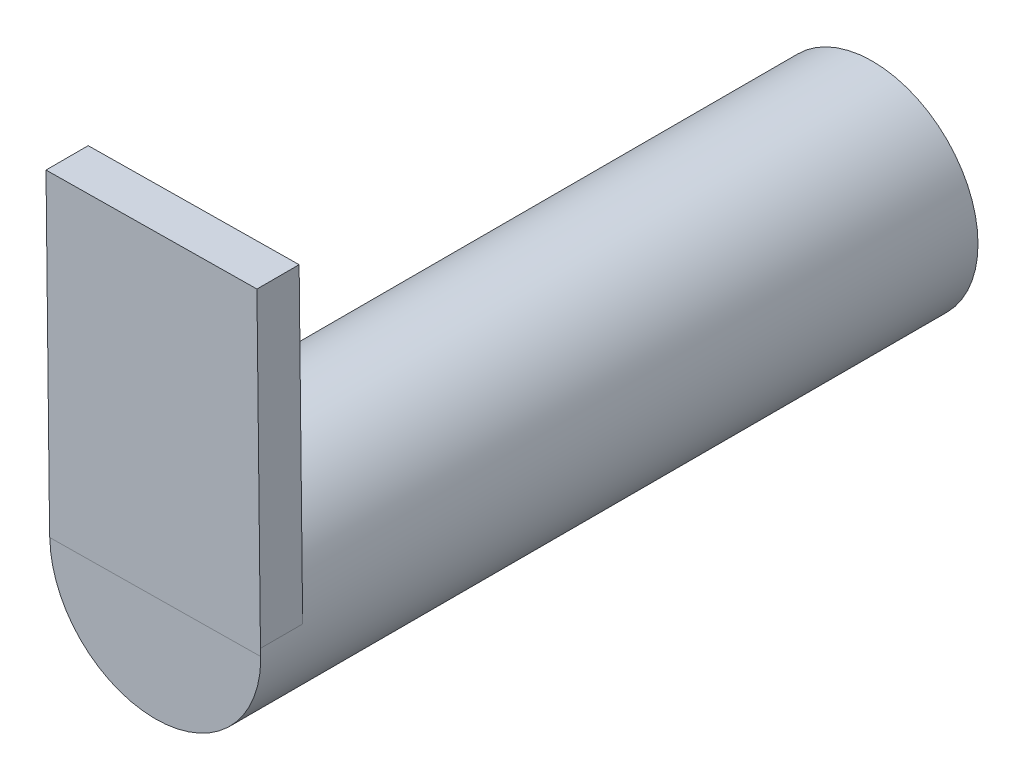
ISO-10303-21;
HEADER;
FILE_DESCRIPTION(('STEP AP214'),'2;1');
FILE_NAME('part.step','',(''),(''),'','','');
FILE_SCHEMA(('AUTOMOTIVE_DESIGN { 1 0 10303 214 1 1 1 1 }'));
ENDSEC;
DATA;
#1=APPLICATION_CONTEXT('core data for automotive mechanical design processes');
#2=APPLICATION_PROTOCOL_DEFINITION('international standard','automotive_design',2000,#1);
#3=PRODUCT_CONTEXT('',#1,'mechanical');
#4=PRODUCT('Part','Part','',(#3));
#5=PRODUCT_RELATED_PRODUCT_CATEGORY('part','',(#4));
#6=PRODUCT_DEFINITION_FORMATION('','',#4);
#7=PRODUCT_DEFINITION_CONTEXT('part definition',#1,'design');
#8=PRODUCT_DEFINITION('design','',#6,#7);
#9=PRODUCT_DEFINITION_SHAPE('','',#8);
#10=(LENGTH_UNIT() NAMED_UNIT(*) SI_UNIT(.MILLI.,.METRE.));
#11=(NAMED_UNIT(*) PLANE_ANGLE_UNIT() SI_UNIT($,.RADIAN.));
#12=(NAMED_UNIT(*) SI_UNIT($,.STERADIAN.) SOLID_ANGLE_UNIT());
#13=UNCERTAINTY_MEASURE_WITH_UNIT(LENGTH_MEASURE(1.E-05),#10,'distance_accuracy_value','');
#14=(GEOMETRIC_REPRESENTATION_CONTEXT(3) GLOBAL_UNCERTAINTY_ASSIGNED_CONTEXT((#13)) GLOBAL_UNIT_ASSIGNED_CONTEXT((#10,
#11,#12)) REPRESENTATION_CONTEXT('',''));
#15=CARTESIAN_POINT('',(0.,0.,0.));
#16=DIRECTION('',(0.,0.,1.));
#17=DIRECTION('',(1.,0.,0.));
#18=AXIS2_PLACEMENT_3D('',#15,#16,#17);
#19=CARTESIAN_POINT('',(-14.9360606750975,10.217847077115,34.));
#20=DIRECTION('',(0.,0.,-1.));
#21=DIRECTION('',(-1.,0.,0.));
#22=AXIS2_PLACEMENT_3D('',#19,#20,#21);
#23=CYLINDRICAL_SURFACE('',#22,4.99999999999989);
#24=CARTESIAN_POINT('',(-14.9360606750975,10.217847077115,0.));
#25=DIRECTION('',(0.,0.,1.));
#26=DIRECTION('',(1.,0.,0.));
#27=AXIS2_PLACEMENT_3D('',#24,#25,#26);
#28=CIRCLE('',#27,4.99999999999989);
#29=CARTESIAN_POINT('',(-9.93606067509756,10.217847077115,0.));
#30=VERTEX_POINT('',#29);
#31=EDGE_CURVE('E115',#30,#30,#28,.T.);
#32=ORIENTED_EDGE('',*,*,#31,.T.);
#33=EDGE_LOOP('',(#32));
#34=FACE_BOUND('',#33,.T.);
#35=DIRECTION('',(0.,0.,-1.));
#36=VECTOR('',#35,1.);
#37=CARTESIAN_POINT('',(-9.95109751990461,10.6053291300785,34.));
#38=LINE('',#37,#36);
#39=CARTESIAN_POINT('',(-9.95109751990461,10.6053291300785,34.));
#40=VERTEX_POINT('',#39);
#41=CARTESIAN_POINT('',(-9.95109751990462,10.6053291300786,32.0000360393137));
#42=VERTEX_POINT('',#41);
#43=EDGE_CURVE('E108',#40,#42,#38,.T.);
#44=ORIENTED_EDGE('',*,*,#43,.F.);
#45=CARTESIAN_POINT('',(-14.9360606750975,10.217847077115,34.));
#46=DIRECTION('',(0.,0.,1.));
#47=DIRECTION('',(1.,0.,0.));
#48=AXIS2_PLACEMENT_3D('',#45,#46,#47);
#49=CIRCLE('',#48,4.99999999999989);
#50=CARTESIAN_POINT('',(-19.9357350538869,10.160784777169,34.));
#51=VERTEX_POINT('',#50);
#52=EDGE_CURVE('E116',#51,#40,#49,.T.);
#53=ORIENTED_EDGE('',*,*,#52,.F.);
#54=DIRECTION('',(0.,0.,-1.));
#55=VECTOR('',#54,1.);
#56=CARTESIAN_POINT('',(-19.9357350538869,10.160784777169,34.));
#57=LINE('',#56,#55);
#58=CARTESIAN_POINT('',(-19.9357350538869,10.160784777169,32.0000360393137));
#59=VERTEX_POINT('',#58);
#60=EDGE_CURVE('E50',#51,#59,#57,.T.);
#61=ORIENTED_EDGE('',*,*,#60,.T.);
#62=CARTESIAN_POINT('',(-14.9360606750975,10.217847077115,32.0000360393137));
#63=DIRECTION('',(0.,0.,1.));
#64=DIRECTION('',(1.,0.,0.));
#65=AXIS2_PLACEMENT_3D('',#62,#63,#64);
#66=CIRCLE('',#65,4.99999999999989);
#67=EDGE_CURVE('E11',#42,#59,#66,.T.);
#68=ORIENTED_EDGE('',*,*,#67,.F.);
#69=EDGE_LOOP('',(#44,#53,#61,#68));
#70=FACE_BOUND('',#69,.T.);
#71=ADVANCED_FACE('F33',(#34,#70),#23,.T.);
#72=CARTESIAN_POINT('',(-14.9360606750975,10.217847077115,34.));
#73=DIRECTION('',(0.,0.,1.));
#74=DIRECTION('',(1.,0.,0.));
#75=AXIS2_PLACEMENT_3D('',#72,#73,#74);
#76=PLANE('',#75);
#77=ORIENTED_EDGE('',*,*,#52,.T.);
#78=DIRECTION('',(0.0114124599892186,-0.999934875757914,0.));
#79=VECTOR('',#78,1.);
#80=CARTESIAN_POINT('',(-9.94732494721862,10.2747845320148,34.));
#81=LINE('',#80,#79);
#82=CARTESIAN_POINT('',(-9.94732494721862,10.2747845320148,34.));
#83=VERTEX_POINT('',#82);
#84=EDGE_CURVE('E40',#40,#83,#81,.T.);
#85=ORIENTED_EDGE('',*,*,#84,.T.);
#86=DIRECTION('',(0.999934875757914,0.0114124599892185,0.));
#87=VECTOR('',#86,1.);
#88=CARTESIAN_POINT('',(-14.9360606750975,10.217847077115,34.));
#89=LINE('',#88,#87);
#90=EDGE_CURVE('E119',#51,#83,#89,.T.);
#91=ORIENTED_EDGE('',*,*,#90,.F.);
#92=EDGE_LOOP('',(#77,#85,#91));
#93=FACE_BOUND('',#92,.T.);
#94=ADVANCED_FACE('F125',(#93),#76,.T.);
#95=CARTESIAN_POINT('',(-14.9360606750975,10.217847077115,0.));
#96=DIRECTION('',(0.,0.,1.));
#97=DIRECTION('',(1.,0.,0.));
#98=AXIS2_PLACEMENT_3D('',#95,#96,#97);
#99=PLANE('',#98);
#100=ORIENTED_EDGE('',*,*,#31,.F.);
#101=EDGE_LOOP('',(#100));
#102=FACE_BOUND('',#101,.T.);
#103=ADVANCED_FACE('F150',(#102),#99,.F.);
#104=CARTESIAN_POINT('',(-20.117860604636,25.1596830684914,32.0000360393137));
#105=DIRECTION('',(0.,0.,1.));
#106=DIRECTION('',(1.,0.,0.));
#107=AXIS2_PLACEMENT_3D('',#104,#105,#106);
#108=PLANE('',#107);
#109=DIRECTION('',(0.0114124599892186,-0.999934875757914,0.));
#110=VECTOR('',#109,1.);
#111=CARTESIAN_POINT('',(-10.1185118470569,25.2738076683835,32.0000360393137));
#112=LINE('',#111,#110);
#113=CARTESIAN_POINT('',(-10.1185118470569,25.2738076683835,32.0000360393137));
#114=VERTEX_POINT('',#113);
#115=EDGE_CURVE('E110',#114,#42,#112,.T.);
#116=ORIENTED_EDGE('',*,*,#115,.T.);
#117=ORIENTED_EDGE('',*,*,#67,.T.);
#118=DIRECTION('',(-0.999934875757914,-0.0114124599892185,0.));
#119=VECTOR('',#118,1.);
#120=CARTESIAN_POINT('',(-19.9466737047978,10.1606599321227,32.0000360393137));
#121=LINE('',#120,#119);
#122=CARTESIAN_POINT('',(-19.9466737047978,10.1606599321227,32.0000360393137));
#123=VERTEX_POINT('',#122);
#124=EDGE_CURVE('E102',#59,#123,#121,.T.);
#125=ORIENTED_EDGE('',*,*,#124,.T.);
#126=DIRECTION('',(0.0114124599892186,-0.999934875757914,0.));
#127=VECTOR('',#126,1.);
#128=CARTESIAN_POINT('',(-20.117860604636,25.1596830684914,32.0000360393137));
#129=LINE('',#128,#127);
#130=CARTESIAN_POINT('',(-20.117860604636,25.1596830684914,32.0000360393137));
#131=VERTEX_POINT('',#130);
#132=EDGE_CURVE('E140',#131,#123,#129,.T.);
#133=ORIENTED_EDGE('',*,*,#132,.F.);
#134=DIRECTION('',(-0.999934875757914,-0.0114124599892185,0.));
#135=VECTOR('',#134,1.);
#136=CARTESIAN_POINT('',(-20.117860604636,25.1596830684914,32.0000360393137));
#137=LINE('',#136,#135);
#138=EDGE_CURVE('E98',#114,#131,#137,.T.);
#139=ORIENTED_EDGE('',*,*,#138,.F.);
#140=EDGE_LOOP('',(#116,#117,#125,#133,#139));
#141=FACE_BOUND('',#140,.T.);
#142=ADVANCED_FACE('F144',(#141),#108,.F.);
#143=CARTESIAN_POINT('',(-10.1185118470569,25.2738076683835,34.0000360393137));
#144=DIRECTION('',(-0.999934875757914,-0.0114124599892186,0.));
#145=DIRECTION('',(0.0114124599892186,-0.999934875757914,0.));
#146=AXIS2_PLACEMENT_3D('',#143,#144,#145);
#147=PLANE('',#146);
#148=ORIENTED_EDGE('',*,*,#84,.F.);
#149=ORIENTED_EDGE('',*,*,#43,.T.);
#150=ORIENTED_EDGE('',*,*,#115,.F.);
#151=DIRECTION('',(0.,0.,-1.));
#152=VECTOR('',#151,1.);
#153=CARTESIAN_POINT('',(-10.1185118470569,25.2738076683835,34.0000360393137));
#154=LINE('',#153,#152);
#155=CARTESIAN_POINT('',(-10.1185118470569,25.2738076683835,34.0000360393137));
#156=VERTEX_POINT('',#155);
#157=EDGE_CURVE('E92',#156,#114,#154,.T.);
#158=ORIENTED_EDGE('',*,*,#157,.F.);
#159=DIRECTION('',(0.0114124599892186,-0.999934875757914,0.));
#160=VECTOR('',#159,1.);
#161=CARTESIAN_POINT('',(-10.1185118470569,25.2738076683835,34.0000360393137));
#162=LINE('',#161,#160);
#163=CARTESIAN_POINT('',(-9.94732494721862,10.2747845320148,34.0000360393137));
#164=VERTEX_POINT('',#163);
#165=EDGE_CURVE('E89',#156,#164,#162,.T.);
#166=ORIENTED_EDGE('',*,*,#165,.T.);
#167=DIRECTION('',(0.,0.,-1.));
#168=VECTOR('',#167,1.);
#169=CARTESIAN_POINT('',(-9.94732494721862,10.2747845320148,34.0000360393137));
#170=LINE('',#169,#168);
#171=EDGE_CURVE('E131',#164,#83,#170,.T.);
#172=ORIENTED_EDGE('',*,*,#171,.T.);
#173=EDGE_LOOP('',(#148,#149,#150,#158,#166,#172));
#174=FACE_BOUND('',#173,.T.);
#175=ADVANCED_FACE('F133',(#174),#147,.F.);
#176=CARTESIAN_POINT('',(-0.118548512671564,10.3869623553128,0.));
#177=DIRECTION('',(0.0114124599892185,-0.999934875757914,0.));
#178=DIRECTION('',(0.999934875757914,0.0114124599892185,0.));
#179=AXIS2_PLACEMENT_3D('',#176,#177,#178);
#180=PLANE('',#179);
#181=ORIENTED_EDGE('',*,*,#60,.F.);
#182=ORIENTED_EDGE('',*,*,#90,.T.);
#183=ORIENTED_EDGE('',*,*,#171,.F.);
#184=DIRECTION('',(0.999934875757914,0.0114124599892185,0.));
#185=VECTOR('',#184,1.);
#186=CARTESIAN_POINT('',(-19.9466737047978,10.1606599321227,34.0000360393137));
#187=LINE('',#186,#185);
#188=CARTESIAN_POINT('',(-19.9466737047978,10.1606599321227,34.0000360393137));
#189=VERTEX_POINT('',#188);
#190=EDGE_CURVE('E134',#189,#164,#187,.T.);
#191=ORIENTED_EDGE('',*,*,#190,.F.);
#192=DIRECTION('',(0.,0.,1.));
#193=VECTOR('',#192,1.);
#194=CARTESIAN_POINT('',(-19.9466737047978,10.1606599321227,34.0000360393137));
#195=LINE('',#194,#193);
#196=EDGE_CURVE('E106',#123,#189,#195,.T.);
#197=ORIENTED_EDGE('',*,*,#196,.F.);
#198=ORIENTED_EDGE('',*,*,#124,.F.);
#199=EDGE_LOOP('',(#181,#182,#183,#191,#197,#198));
#200=FACE_BOUND('',#199,.T.);
#201=ADVANCED_FACE('F130',(#200),#180,.T.);
#202=CARTESIAN_POINT('',(-20.117860604636,25.1596830684914,34.0000360393137));
#203=DIRECTION('',(0.999934875757914,0.0114124599892186,0.));
#204=DIRECTION('',(-0.0114124599892186,0.999934875757914,0.));
#205=AXIS2_PLACEMENT_3D('',#202,#203,#204);
#206=PLANE('',#205);
#207=ORIENTED_EDGE('',*,*,#196,.T.);
#208=DIRECTION('',(0.0114124599892186,-0.999934875757914,0.));
#209=VECTOR('',#208,1.);
#210=CARTESIAN_POINT('',(-20.117860604636,25.1596830684914,34.0000360393137));
#211=LINE('',#210,#209);
#212=CARTESIAN_POINT('',(-20.117860604636,25.1596830684914,34.0000360393137));
#213=VERTEX_POINT('',#212);
#214=EDGE_CURVE('E86',#213,#189,#211,.T.);
#215=ORIENTED_EDGE('',*,*,#214,.F.);
#216=DIRECTION('',(0.,0.,1.));
#217=VECTOR('',#216,1.);
#218=CARTESIAN_POINT('',(-20.117860604636,25.1596830684914,34.0000360393137));
#219=LINE('',#218,#217);
#220=EDGE_CURVE('E93',#131,#213,#219,.T.);
#221=ORIENTED_EDGE('',*,*,#220,.F.);
#222=ORIENTED_EDGE('',*,*,#132,.T.);
#223=EDGE_LOOP('',(#207,#215,#221,#222));
#224=FACE_BOUND('',#223,.T.);
#225=ADVANCED_FACE('F104',(#224),#206,.F.);
#226=CARTESIAN_POINT('',(-20.117860604636,25.1596830684914,34.0000360393137));
#227=DIRECTION('',(0.,0.,-1.));
#228=DIRECTION('',(-1.,0.,0.));
#229=AXIS2_PLACEMENT_3D('',#226,#227,#228);
#230=PLANE('',#229);
#231=ORIENTED_EDGE('',*,*,#190,.T.);
#232=ORIENTED_EDGE('',*,*,#165,.F.);
#233=DIRECTION('',(0.999934875757914,0.0114124599892185,0.));
#234=VECTOR('',#233,1.);
#235=CARTESIAN_POINT('',(-20.117860604636,25.1596830684914,34.0000360393137));
#236=LINE('',#235,#234);
#237=EDGE_CURVE('E82',#213,#156,#236,.T.);
#238=ORIENTED_EDGE('',*,*,#237,.F.);
#239=ORIENTED_EDGE('',*,*,#214,.T.);
#240=EDGE_LOOP('',(#231,#232,#238,#239));
#241=FACE_BOUND('',#240,.T.);
#242=ADVANCED_FACE('F84',(#241),#230,.F.);
#243=CARTESIAN_POINT('',(-0.289735412509843,25.3859854916815,0.));
#244=DIRECTION('',(0.0114124599892185,-0.999934875757914,0.));
#245=DIRECTION('',(0.999934875757914,0.0114124599892185,0.));
#246=AXIS2_PLACEMENT_3D('',#243,#244,#245);
#247=PLANE('',#246);
#248=ORIENTED_EDGE('',*,*,#220,.T.);
#249=ORIENTED_EDGE('',*,*,#237,.T.);
#250=ORIENTED_EDGE('',*,*,#157,.T.);
#251=ORIENTED_EDGE('',*,*,#138,.T.);
#252=EDGE_LOOP('',(#248,#249,#250,#251));
#253=FACE_BOUND('',#252,.T.);
#254=ADVANCED_FACE('F96',(#253),#247,.F.);
#255=CLOSED_SHELL('',(#71,#94,#103,#142,#175,#201,#225,#242,#254));
#256=MANIFOLD_SOLID_BREP('B2',#255);
#257=ADVANCED_BREP_SHAPE_REPRESENTATION('',(#18,#256),#14);
#258=SHAPE_DEFINITION_REPRESENTATION(#9,#257);
ENDSEC;
END-ISO-10303-21;
